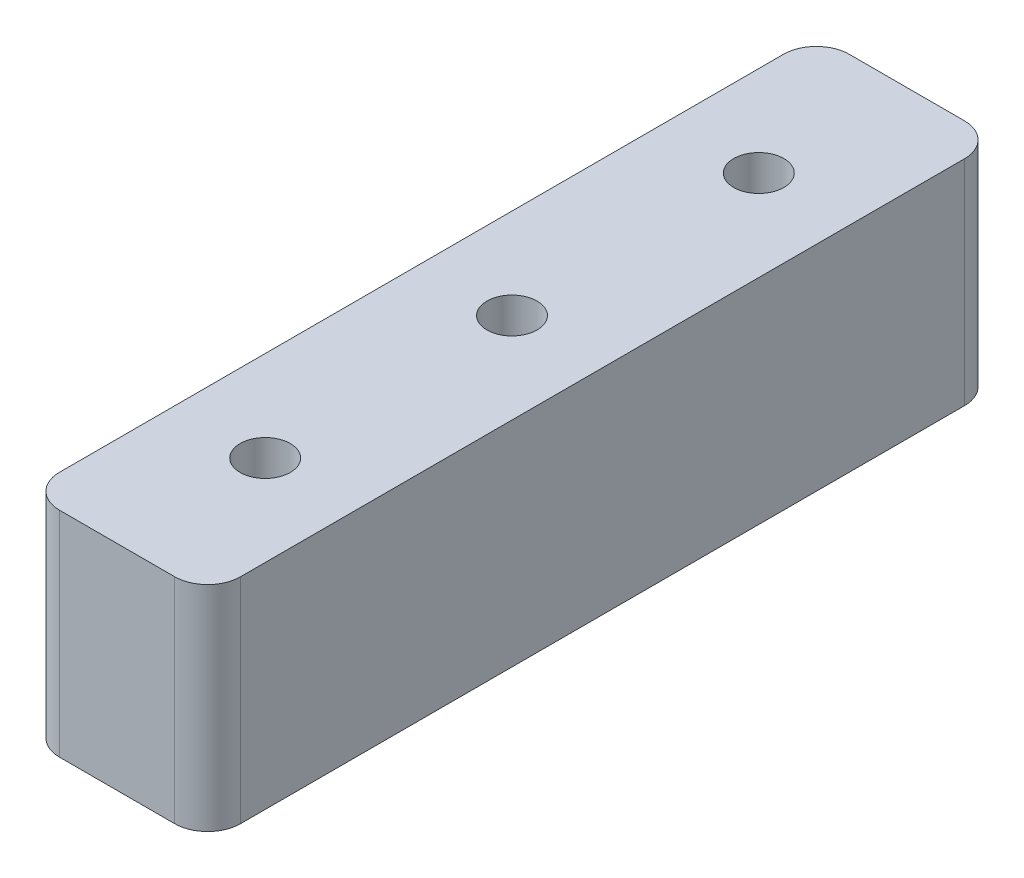
ISO-10303-21;
HEADER;
FILE_DESCRIPTION(('STEP AP214'),'2;1');
FILE_NAME('part.step','',(''),(''),'','','');
FILE_SCHEMA(('AUTOMOTIVE_DESIGN { 1 0 10303 214 1 1 1 1 }'));
ENDSEC;
DATA;
#1=APPLICATION_CONTEXT('core data for automotive mechanical design processes');
#2=APPLICATION_PROTOCOL_DEFINITION('international standard','automotive_design',2000,#1);
#3=PRODUCT_CONTEXT('',#1,'mechanical');
#4=PRODUCT('Part','Part','',(#3));
#5=PRODUCT_RELATED_PRODUCT_CATEGORY('part','',(#4));
#6=PRODUCT_DEFINITION_FORMATION('','',#4);
#7=PRODUCT_DEFINITION_CONTEXT('part definition',#1,'design');
#8=PRODUCT_DEFINITION('design','',#6,#7);
#9=PRODUCT_DEFINITION_SHAPE('','',#8);
#10=(LENGTH_UNIT() NAMED_UNIT(*) SI_UNIT(.MILLI.,.METRE.));
#11=(NAMED_UNIT(*) PLANE_ANGLE_UNIT() SI_UNIT($,.RADIAN.));
#12=(NAMED_UNIT(*) SI_UNIT($,.STERADIAN.) SOLID_ANGLE_UNIT());
#13=UNCERTAINTY_MEASURE_WITH_UNIT(LENGTH_MEASURE(1.E-05),#10,'distance_accuracy_value','');
#14=(GEOMETRIC_REPRESENTATION_CONTEXT(3) GLOBAL_UNCERTAINTY_ASSIGNED_CONTEXT((#13)) GLOBAL_UNIT_ASSIGNED_CONTEXT((#10,
#11,#12)) REPRESENTATION_CONTEXT('',''));
#15=CARTESIAN_POINT('',(0.,0.,0.));
#16=DIRECTION('',(0.,0.,1.));
#17=DIRECTION('',(1.,0.,0.));
#18=AXIS2_PLACEMENT_3D('',#15,#16,#17);
#19=CARTESIAN_POINT('',(5.5,13.,24.));
#20=DIRECTION('',(-1.,0.,0.));
#21=DIRECTION('',(0.,0.,1.));
#22=AXIS2_PLACEMENT_3D('',#19,#20,#21);
#23=PLANE('',#22);
#24=DIRECTION('',(0.,0.,-1.));
#25=VECTOR('',#24,1.);
#26=CARTESIAN_POINT('',(5.5,13.,24.));
#27=LINE('',#26,#25);
#28=CARTESIAN_POINT('',(5.5,13.,22.));
#29=VERTEX_POINT('',#28);
#30=CARTESIAN_POINT('',(5.5,13.,-22.));
#31=VERTEX_POINT('',#30);
#32=EDGE_CURVE('E131',#29,#31,#27,.T.);
#33=ORIENTED_EDGE('',*,*,#32,.F.);
#34=DIRECTION('',(0.,-1.,0.));
#35=VECTOR('',#34,1.);
#36=CARTESIAN_POINT('',(5.5,13.,22.));
#37=LINE('',#36,#35);
#38=CARTESIAN_POINT('',(5.5,0.,22.));
#39=VERTEX_POINT('',#38);
#40=EDGE_CURVE('E115',#29,#39,#37,.T.);
#41=ORIENTED_EDGE('',*,*,#40,.T.);
#42=DIRECTION('',(0.,0.,-1.));
#43=VECTOR('',#42,1.);
#44=CARTESIAN_POINT('',(5.5,0.,24.));
#45=LINE('',#44,#43);
#46=CARTESIAN_POINT('',(5.5,0.,-22.));
#47=VERTEX_POINT('',#46);
#48=EDGE_CURVE('E128',#39,#47,#45,.T.);
#49=ORIENTED_EDGE('',*,*,#48,.T.);
#50=DIRECTION('',(0.,-1.,0.));
#51=VECTOR('',#50,1.);
#52=CARTESIAN_POINT('',(5.5,13.,-22.));
#53=LINE('',#52,#51);
#54=EDGE_CURVE('E134',#47,#31,#53,.F.);
#55=ORIENTED_EDGE('',*,*,#54,.T.);
#56=EDGE_LOOP('',(#33,#41,#49,#55));
#57=FACE_BOUND('',#56,.T.);
#58=ADVANCED_FACE('F43',(#57),#23,.F.);
#59=CARTESIAN_POINT('',(-5.5,13.,-24.));
#60=DIRECTION('',(0.,0.,1.));
#61=DIRECTION('',(1.,0.,0.));
#62=AXIS2_PLACEMENT_3D('',#59,#60,#61);
#63=PLANE('',#62);
#64=DIRECTION('',(-1.,0.,0.));
#65=VECTOR('',#64,1.);
#66=CARTESIAN_POINT('',(-5.5,13.,-24.));
#67=LINE('',#66,#65);
#68=CARTESIAN_POINT('',(3.5,13.,-24.));
#69=VERTEX_POINT('',#68);
#70=CARTESIAN_POINT('',(-3.5,13.,-24.));
#71=VERTEX_POINT('',#70);
#72=EDGE_CURVE('E194',#69,#71,#67,.T.);
#73=ORIENTED_EDGE('',*,*,#72,.F.);
#74=DIRECTION('',(0.,-1.,0.));
#75=VECTOR('',#74,1.);
#76=CARTESIAN_POINT('',(3.5,13.,-24.));
#77=LINE('',#76,#75);
#78=CARTESIAN_POINT('',(3.5,0.,-24.));
#79=VERTEX_POINT('',#78);
#80=EDGE_CURVE('E11',#69,#79,#77,.T.);
#81=ORIENTED_EDGE('',*,*,#80,.T.);
#82=DIRECTION('',(-1.,0.,0.));
#83=VECTOR('',#82,1.);
#84=CARTESIAN_POINT('',(-5.5,0.,-24.));
#85=LINE('',#84,#83);
#86=CARTESIAN_POINT('',(-3.5,0.,-24.));
#87=VERTEX_POINT('',#86);
#88=EDGE_CURVE('E140',#79,#87,#85,.T.);
#89=ORIENTED_EDGE('',*,*,#88,.T.);
#90=DIRECTION('',(0.,-1.,0.));
#91=VECTOR('',#90,1.);
#92=CARTESIAN_POINT('',(-3.5,13.,-24.));
#93=LINE('',#92,#91);
#94=EDGE_CURVE('E52',#87,#71,#93,.F.);
#95=ORIENTED_EDGE('',*,*,#94,.T.);
#96=EDGE_LOOP('',(#73,#81,#89,#95));
#97=FACE_BOUND('',#96,.T.);
#98=ADVANCED_FACE('F193',(#97),#63,.F.);
#99=CARTESIAN_POINT('',(-5.5,13.,24.));
#100=DIRECTION('',(1.,0.,0.));
#101=DIRECTION('',(0.,0.,-1.));
#102=AXIS2_PLACEMENT_3D('',#99,#100,#101);
#103=PLANE('',#102);
#104=DIRECTION('',(0.,0.,1.));
#105=VECTOR('',#104,1.);
#106=CARTESIAN_POINT('',(-5.5,0.,24.));
#107=LINE('',#106,#105);
#108=CARTESIAN_POINT('',(-5.5,0.,-22.));
#109=VERTEX_POINT('',#108);
#110=CARTESIAN_POINT('',(-5.5,0.,22.));
#111=VERTEX_POINT('',#110);
#112=EDGE_CURVE('E146',#109,#111,#107,.T.);
#113=ORIENTED_EDGE('',*,*,#112,.T.);
#114=DIRECTION('',(0.,-1.,0.));
#115=VECTOR('',#114,1.);
#116=CARTESIAN_POINT('',(-5.5,13.,22.));
#117=LINE('',#116,#115);
#118=CARTESIAN_POINT('',(-5.5,13.,22.));
#119=VERTEX_POINT('',#118);
#120=EDGE_CURVE('E59',#111,#119,#117,.F.);
#121=ORIENTED_EDGE('',*,*,#120,.T.);
#122=DIRECTION('',(0.,0.,1.));
#123=VECTOR('',#122,1.);
#124=CARTESIAN_POINT('',(-5.5,13.,24.));
#125=LINE('',#124,#123);
#126=CARTESIAN_POINT('',(-5.5,13.,-22.));
#127=VERTEX_POINT('',#126);
#128=EDGE_CURVE('E201',#127,#119,#125,.T.);
#129=ORIENTED_EDGE('',*,*,#128,.F.);
#130=DIRECTION('',(0.,-1.,0.));
#131=VECTOR('',#130,1.);
#132=CARTESIAN_POINT('',(-5.5,13.,-22.));
#133=LINE('',#132,#131);
#134=EDGE_CURVE('E184',#127,#109,#133,.T.);
#135=ORIENTED_EDGE('',*,*,#134,.T.);
#136=EDGE_LOOP('',(#113,#121,#129,#135));
#137=FACE_BOUND('',#136,.T.);
#138=ADVANCED_FACE('F205',(#137),#103,.F.);
#139=CARTESIAN_POINT('',(-5.5,13.,24.));
#140=DIRECTION('',(0.,0.,-1.));
#141=DIRECTION('',(-1.,0.,0.));
#142=AXIS2_PLACEMENT_3D('',#139,#140,#141);
#143=PLANE('',#142);
#144=DIRECTION('',(1.,0.,0.));
#145=VECTOR('',#144,1.);
#146=CARTESIAN_POINT('',(-5.5,0.,24.));
#147=LINE('',#146,#145);
#148=CARTESIAN_POINT('',(-3.5,0.,24.));
#149=VERTEX_POINT('',#148);
#150=CARTESIAN_POINT('',(3.5,0.,24.));
#151=VERTEX_POINT('',#150);
#152=EDGE_CURVE('E157',#149,#151,#147,.T.);
#153=ORIENTED_EDGE('',*,*,#152,.T.);
#154=DIRECTION('',(0.,-1.,0.));
#155=VECTOR('',#154,1.);
#156=CARTESIAN_POINT('',(3.5,13.,24.));
#157=LINE('',#156,#155);
#158=CARTESIAN_POINT('',(3.5,13.,24.));
#159=VERTEX_POINT('',#158);
#160=EDGE_CURVE('E116',#151,#159,#157,.F.);
#161=ORIENTED_EDGE('',*,*,#160,.T.);
#162=DIRECTION('',(1.,0.,0.));
#163=VECTOR('',#162,1.);
#164=CARTESIAN_POINT('',(-5.5,13.,24.));
#165=LINE('',#164,#163);
#166=CARTESIAN_POINT('',(-3.5,13.,24.));
#167=VERTEX_POINT('',#166);
#168=EDGE_CURVE('E152',#167,#159,#165,.T.);
#169=ORIENTED_EDGE('',*,*,#168,.F.);
#170=DIRECTION('',(0.,-1.,0.));
#171=VECTOR('',#170,1.);
#172=CARTESIAN_POINT('',(-3.5,13.,24.));
#173=LINE('',#172,#171);
#174=EDGE_CURVE('E122',#167,#149,#173,.T.);
#175=ORIENTED_EDGE('',*,*,#174,.T.);
#176=EDGE_LOOP('',(#153,#161,#169,#175));
#177=FACE_BOUND('',#176,.T.);
#178=ADVANCED_FACE('F212',(#177),#143,.F.);
#179=CARTESIAN_POINT('',(0.,13.,0.));
#180=DIRECTION('',(0.,-1.,0.));
#181=DIRECTION('',(0.,0.,-1.));
#182=AXIS2_PLACEMENT_3D('',#179,#180,#181);
#183=PLANE('',#182);
#184=CARTESIAN_POINT('',(0.,13.,15.));
#185=DIRECTION('',(0.,1.,0.));
#186=DIRECTION('',(0.,0.,-1.));
#187=AXIS2_PLACEMENT_3D('',#184,#185,#186);
#188=CIRCLE('',#187,1.525);
#189=CARTESIAN_POINT('',(0.,13.,13.475));
#190=VERTEX_POINT('',#189);
#191=EDGE_CURVE('E226',#190,#190,#188,.T.);
#192=ORIENTED_EDGE('',*,*,#191,.F.);
#193=EDGE_LOOP('',(#192));
#194=FACE_BOUND('',#193,.T.);
#195=CARTESIAN_POINT('',(0.,13.,-15.));
#196=DIRECTION('',(0.,1.,0.));
#197=DIRECTION('',(0.,0.,1.));
#198=AXIS2_PLACEMENT_3D('',#195,#196,#197);
#199=CIRCLE('',#198,1.525);
#200=CARTESIAN_POINT('',(0.,13.,-13.475));
#201=VERTEX_POINT('',#200);
#202=EDGE_CURVE('E220',#201,#201,#199,.T.);
#203=ORIENTED_EDGE('',*,*,#202,.F.);
#204=EDGE_LOOP('',(#203));
#205=FACE_BOUND('',#204,.T.);
#206=CARTESIAN_POINT('',(0.,13.,0.));
#207=DIRECTION('',(0.,1.,0.));
#208=DIRECTION('',(0.,0.,1.));
#209=AXIS2_PLACEMENT_3D('',#206,#207,#208);
#210=CIRCLE('',#209,1.525);
#211=CARTESIAN_POINT('',(0.,13.,1.525));
#212=VERTEX_POINT('',#211);
#213=EDGE_CURVE('E149',#212,#212,#210,.T.);
#214=ORIENTED_EDGE('',*,*,#213,.F.);
#215=EDGE_LOOP('',(#214));
#216=FACE_BOUND('',#215,.T.);
#217=ORIENTED_EDGE('',*,*,#168,.T.);
#218=CARTESIAN_POINT('',(3.5,13.,22.));
#219=DIRECTION('',(0.,-1.,0.));
#220=DIRECTION('',(0.,0.,-1.));
#221=AXIS2_PLACEMENT_3D('',#218,#219,#220);
#222=CIRCLE('',#221,2.);
#223=EDGE_CURVE('E181',#159,#29,#222,.F.);
#224=ORIENTED_EDGE('',*,*,#223,.T.);
#225=ORIENTED_EDGE('',*,*,#32,.T.);
#226=CARTESIAN_POINT('',(3.5,13.,-22.));
#227=DIRECTION('',(0.,-1.,0.));
#228=DIRECTION('',(0.,0.,-1.));
#229=AXIS2_PLACEMENT_3D('',#226,#227,#228);
#230=CIRCLE('',#229,2.);
#231=EDGE_CURVE('E175',#31,#69,#230,.F.);
#232=ORIENTED_EDGE('',*,*,#231,.T.);
#233=ORIENTED_EDGE('',*,*,#72,.T.);
#234=CARTESIAN_POINT('',(-3.5,13.,-22.));
#235=DIRECTION('',(0.,-1.,0.));
#236=DIRECTION('',(0.,0.,-1.));
#237=AXIS2_PLACEMENT_3D('',#234,#235,#236);
#238=CIRCLE('',#237,2.);
#239=EDGE_CURVE('E66',#71,#127,#238,.F.);
#240=ORIENTED_EDGE('',*,*,#239,.T.);
#241=ORIENTED_EDGE('',*,*,#128,.T.);
#242=CARTESIAN_POINT('',(-3.5,13.,22.));
#243=DIRECTION('',(0.,-1.,0.));
#244=DIRECTION('',(0.,0.,-1.));
#245=AXIS2_PLACEMENT_3D('',#242,#243,#244);
#246=CIRCLE('',#245,2.);
#247=EDGE_CURVE('E178',#119,#167,#246,.F.);
#248=ORIENTED_EDGE('',*,*,#247,.T.);
#249=EDGE_LOOP('',(#217,#224,#225,#232,#233,#240,#241,#248));
#250=FACE_BOUND('',#249,.T.);
#251=ADVANCED_FACE('F198',(#194,#205,#216,#250),#183,.F.);
#252=CARTESIAN_POINT('',(0.,0.,0.));
#253=DIRECTION('',(0.,-1.,0.));
#254=DIRECTION('',(0.,0.,-1.));
#255=AXIS2_PLACEMENT_3D('',#252,#253,#254);
#256=PLANE('',#255);
#257=CARTESIAN_POINT('',(0.,0.,15.));
#258=DIRECTION('',(0.,1.,0.));
#259=DIRECTION('',(0.,0.,-1.));
#260=AXIS2_PLACEMENT_3D('',#257,#258,#259);
#261=CIRCLE('',#260,1.525);
#262=CARTESIAN_POINT('',(0.,0.,13.475));
#263=VERTEX_POINT('',#262);
#264=EDGE_CURVE('E222',#263,#263,#261,.T.);
#265=ORIENTED_EDGE('',*,*,#264,.T.);
#266=EDGE_LOOP('',(#265));
#267=FACE_BOUND('',#266,.T.);
#268=CARTESIAN_POINT('',(0.,0.,-15.));
#269=DIRECTION('',(0.,1.,0.));
#270=DIRECTION('',(0.,0.,1.));
#271=AXIS2_PLACEMENT_3D('',#268,#269,#270);
#272=CIRCLE('',#271,1.525);
#273=CARTESIAN_POINT('',(0.,0.,-13.475));
#274=VERTEX_POINT('',#273);
#275=EDGE_CURVE('E230',#274,#274,#272,.T.);
#276=ORIENTED_EDGE('',*,*,#275,.T.);
#277=EDGE_LOOP('',(#276));
#278=FACE_BOUND('',#277,.T.);
#279=CARTESIAN_POINT('',(0.,0.,0.));
#280=DIRECTION('',(0.,1.,0.));
#281=DIRECTION('',(0.,0.,1.));
#282=AXIS2_PLACEMENT_3D('',#279,#280,#281);
#283=CIRCLE('',#282,1.525);
#284=CARTESIAN_POINT('',(0.,0.,1.525));
#285=VERTEX_POINT('',#284);
#286=EDGE_CURVE('E141',#285,#285,#283,.T.);
#287=ORIENTED_EDGE('',*,*,#286,.T.);
#288=EDGE_LOOP('',(#287));
#289=FACE_BOUND('',#288,.T.);
#290=ORIENTED_EDGE('',*,*,#48,.F.);
#291=CARTESIAN_POINT('',(3.5,0.,22.));
#292=DIRECTION('',(0.,-1.,0.));
#293=DIRECTION('',(0.,0.,-1.));
#294=AXIS2_PLACEMENT_3D('',#291,#292,#293);
#295=CIRCLE('',#294,2.);
#296=EDGE_CURVE('E111',#39,#151,#295,.T.);
#297=ORIENTED_EDGE('',*,*,#296,.T.);
#298=ORIENTED_EDGE('',*,*,#152,.F.);
#299=CARTESIAN_POINT('',(-3.5,0.,22.));
#300=DIRECTION('',(0.,-1.,0.));
#301=DIRECTION('',(0.,0.,-1.));
#302=AXIS2_PLACEMENT_3D('',#299,#300,#301);
#303=CIRCLE('',#302,2.);
#304=EDGE_CURVE('E123',#149,#111,#303,.T.);
#305=ORIENTED_EDGE('',*,*,#304,.T.);
#306=ORIENTED_EDGE('',*,*,#112,.F.);
#307=CARTESIAN_POINT('',(-3.5,0.,-22.));
#308=DIRECTION('',(0.,-1.,0.));
#309=DIRECTION('',(0.,0.,-1.));
#310=AXIS2_PLACEMENT_3D('',#307,#308,#309);
#311=CIRCLE('',#310,2.);
#312=EDGE_CURVE('E133',#109,#87,#311,.T.);
#313=ORIENTED_EDGE('',*,*,#312,.T.);
#314=ORIENTED_EDGE('',*,*,#88,.F.);
#315=CARTESIAN_POINT('',(3.5,0.,-22.));
#316=DIRECTION('',(0.,-1.,0.));
#317=DIRECTION('',(0.,0.,-1.));
#318=AXIS2_PLACEMENT_3D('',#315,#316,#317);
#319=CIRCLE('',#318,2.);
#320=EDGE_CURVE('E138',#79,#47,#319,.T.);
#321=ORIENTED_EDGE('',*,*,#320,.T.);
#322=EDGE_LOOP('',(#290,#297,#298,#305,#306,#313,#314,#321));
#323=FACE_BOUND('',#322,.T.);
#324=ADVANCED_FACE('F136',(#267,#278,#289,#323),#256,.T.);
#325=CARTESIAN_POINT('',(3.5,13.,22.));
#326=DIRECTION('',(0.,-1.,0.));
#327=DIRECTION('',(0.,0.,-1.));
#328=AXIS2_PLACEMENT_3D('',#325,#326,#327);
#329=CYLINDRICAL_SURFACE('',#328,2.);
#330=ORIENTED_EDGE('',*,*,#223,.F.);
#331=ORIENTED_EDGE('',*,*,#160,.F.);
#332=ORIENTED_EDGE('',*,*,#296,.F.);
#333=ORIENTED_EDGE('',*,*,#40,.F.);
#334=EDGE_LOOP('',(#330,#331,#332,#333));
#335=FACE_BOUND('',#334,.T.);
#336=ADVANCED_FACE('F114',(#335),#329,.T.);
#337=CARTESIAN_POINT('',(-3.5,13.,22.));
#338=DIRECTION('',(0.,-1.,0.));
#339=DIRECTION('',(0.,0.,-1.));
#340=AXIS2_PLACEMENT_3D('',#337,#338,#339);
#341=CYLINDRICAL_SURFACE('',#340,2.);
#342=ORIENTED_EDGE('',*,*,#247,.F.);
#343=ORIENTED_EDGE('',*,*,#120,.F.);
#344=ORIENTED_EDGE('',*,*,#304,.F.);
#345=ORIENTED_EDGE('',*,*,#174,.F.);
#346=EDGE_LOOP('',(#342,#343,#344,#345));
#347=FACE_BOUND('',#346,.T.);
#348=ADVANCED_FACE('F209',(#347),#341,.T.);
#349=CARTESIAN_POINT('',(3.5,13.,-22.));
#350=DIRECTION('',(0.,-1.,0.));
#351=DIRECTION('',(0.,0.,-1.));
#352=AXIS2_PLACEMENT_3D('',#349,#350,#351);
#353=CYLINDRICAL_SURFACE('',#352,2.);
#354=ORIENTED_EDGE('',*,*,#231,.F.);
#355=ORIENTED_EDGE('',*,*,#54,.F.);
#356=ORIENTED_EDGE('',*,*,#320,.F.);
#357=ORIENTED_EDGE('',*,*,#80,.F.);
#358=EDGE_LOOP('',(#354,#355,#356,#357));
#359=FACE_BOUND('',#358,.T.);
#360=ADVANCED_FACE('F257',(#359),#353,.T.);
#361=CARTESIAN_POINT('',(-3.5,13.,-22.));
#362=DIRECTION('',(0.,-1.,0.));
#363=DIRECTION('',(0.,0.,-1.));
#364=AXIS2_PLACEMENT_3D('',#361,#362,#363);
#365=CYLINDRICAL_SURFACE('',#364,2.);
#366=ORIENTED_EDGE('',*,*,#239,.F.);
#367=ORIENTED_EDGE('',*,*,#94,.F.);
#368=ORIENTED_EDGE('',*,*,#312,.F.);
#369=ORIENTED_EDGE('',*,*,#134,.F.);
#370=EDGE_LOOP('',(#366,#367,#368,#369));
#371=FACE_BOUND('',#370,.T.);
#372=ADVANCED_FACE('F45',(#371),#365,.T.);
#373=CARTESIAN_POINT('',(0.,0.,0.));
#374=DIRECTION('',(0.,1.,0.));
#375=DIRECTION('',(0.,0.,1.));
#376=AXIS2_PLACEMENT_3D('',#373,#374,#375);
#377=CYLINDRICAL_SURFACE('',#376,1.525);
#378=ORIENTED_EDGE('',*,*,#286,.F.);
#379=EDGE_LOOP('',(#378));
#380=FACE_BOUND('',#379,.T.);
#381=ORIENTED_EDGE('',*,*,#213,.T.);
#382=EDGE_LOOP('',(#381));
#383=FACE_BOUND('',#382,.T.);
#384=ADVANCED_FACE('F246',(#380,#383),#377,.F.);
#385=CARTESIAN_POINT('',(0.,0.,-15.));
#386=DIRECTION('',(0.,1.,0.));
#387=DIRECTION('',(0.,0.,1.));
#388=AXIS2_PLACEMENT_3D('',#385,#386,#387);
#389=CYLINDRICAL_SURFACE('',#388,1.525);
#390=ORIENTED_EDGE('',*,*,#275,.F.);
#391=EDGE_LOOP('',(#390));
#392=FACE_BOUND('',#391,.T.);
#393=ORIENTED_EDGE('',*,*,#202,.T.);
#394=EDGE_LOOP('',(#393));
#395=FACE_BOUND('',#394,.T.);
#396=ADVANCED_FACE('F238',(#392,#395),#389,.F.);
#397=CARTESIAN_POINT('',(0.,0.,15.));
#398=DIRECTION('',(0.,1.,0.));
#399=DIRECTION('',(0.,0.,1.));
#400=AXIS2_PLACEMENT_3D('',#397,#398,#399);
#401=CYLINDRICAL_SURFACE('',#400,1.525);
#402=ORIENTED_EDGE('',*,*,#264,.F.);
#403=EDGE_LOOP('',(#402));
#404=FACE_BOUND('',#403,.T.);
#405=ORIENTED_EDGE('',*,*,#191,.T.);
#406=EDGE_LOOP('',(#405));
#407=FACE_BOUND('',#406,.T.);
#408=ADVANCED_FACE('F254',(#404,#407),#401,.F.);
#409=CLOSED_SHELL('',(#58,#98,#138,#178,#251,#324,#336,#348,#360,#372,#384,#396,#408));
#410=MANIFOLD_SOLID_BREP('B2',#409);
#411=ADVANCED_BREP_SHAPE_REPRESENTATION('',(#18,#410),#14);
#412=SHAPE_DEFINITION_REPRESENTATION(#9,#411);
ENDSEC;
END-ISO-10303-21;
